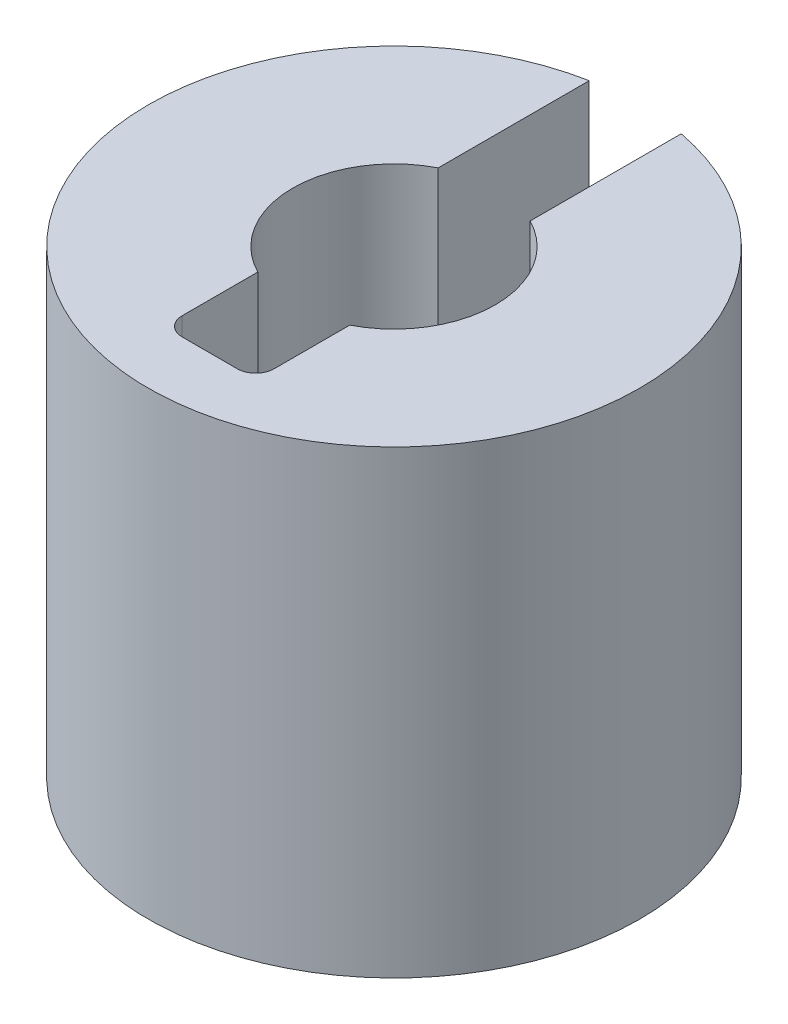
ISO-10303-21;
HEADER;
FILE_DESCRIPTION(('STEP AP214'),'2;1');
FILE_NAME('part.step','',(''),(''),'','','');
FILE_SCHEMA(('AUTOMOTIVE_DESIGN { 1 0 10303 214 1 1 1 1 }'));
ENDSEC;
DATA;
#1=APPLICATION_CONTEXT('core data for automotive mechanical design processes');
#2=APPLICATION_PROTOCOL_DEFINITION('international standard','automotive_design',2000,#1);
#3=PRODUCT_CONTEXT('',#1,'mechanical');
#4=PRODUCT('Part','Part','',(#3));
#5=PRODUCT_RELATED_PRODUCT_CATEGORY('part','',(#4));
#6=PRODUCT_DEFINITION_FORMATION('','',#4);
#7=PRODUCT_DEFINITION_CONTEXT('part definition',#1,'design');
#8=PRODUCT_DEFINITION('design','',#6,#7);
#9=PRODUCT_DEFINITION_SHAPE('','',#8);
#10=(LENGTH_UNIT() NAMED_UNIT(*) SI_UNIT(.MILLI.,.METRE.));
#11=(NAMED_UNIT(*) PLANE_ANGLE_UNIT() SI_UNIT($,.RADIAN.));
#12=(NAMED_UNIT(*) SI_UNIT($,.STERADIAN.) SOLID_ANGLE_UNIT());
#13=UNCERTAINTY_MEASURE_WITH_UNIT(LENGTH_MEASURE(1.E-05),#10,'distance_accuracy_value','');
#14=(GEOMETRIC_REPRESENTATION_CONTEXT(3) GLOBAL_UNCERTAINTY_ASSIGNED_CONTEXT((#13)) GLOBAL_UNIT_ASSIGNED_CONTEXT((#10,
#11,#12)) REPRESENTATION_CONTEXT('',''));
#15=CARTESIAN_POINT('',(0.,0.,0.));
#16=DIRECTION('',(0.,0.,1.));
#17=DIRECTION('',(1.,0.,0.));
#18=AXIS2_PLACEMENT_3D('',#15,#16,#17);
#19=CARTESIAN_POINT('',(-0.75,3.75,3.005));
#20=DIRECTION('',(0.,0.,1.));
#21=DIRECTION('',(1.,0.,0.));
#22=AXIS2_PLACEMENT_3D('',#19,#20,#21);
#23=PLANE('',#22);
#24=DIRECTION('',(0.,1.,0.));
#25=VECTOR('',#24,1.);
#26=CARTESIAN_POINT('',(-0.45,3.75,3.005));
#27=LINE('',#26,#25);
#28=CARTESIAN_POINT('',(-0.45,-3.75,3.005));
#29=VERTEX_POINT('',#28);
#30=CARTESIAN_POINT('',(-0.45,3.75,3.005));
#31=VERTEX_POINT('',#30);
#32=EDGE_CURVE('E114',#29,#31,#27,.T.);
#33=ORIENTED_EDGE('',*,*,#32,.T.);
#34=DIRECTION('',(1.,0.,0.));
#35=VECTOR('',#34,1.);
#36=CARTESIAN_POINT('',(-0.75,3.75,3.005));
#37=LINE('',#36,#35);
#38=CARTESIAN_POINT('',(0.45,3.75,3.005));
#39=VERTEX_POINT('',#38);
#40=EDGE_CURVE('E102',#39,#31,#37,.F.);
#41=ORIENTED_EDGE('',*,*,#40,.F.);
#42=DIRECTION('',(0.,1.,0.));
#43=VECTOR('',#42,1.);
#44=CARTESIAN_POINT('',(0.45,3.75,3.005));
#45=LINE('',#44,#43);
#46=CARTESIAN_POINT('',(0.45,-3.75,3.005));
#47=VERTEX_POINT('',#46);
#48=EDGE_CURVE('E101',#39,#47,#45,.F.);
#49=ORIENTED_EDGE('',*,*,#48,.T.);
#50=DIRECTION('',(1.,0.,0.));
#51=VECTOR('',#50,1.);
#52=CARTESIAN_POINT('',(-0.75,-3.75,3.005));
#53=LINE('',#52,#51);
#54=EDGE_CURVE('E91',#29,#47,#53,.T.);
#55=ORIENTED_EDGE('',*,*,#54,.F.);
#56=EDGE_LOOP('',(#33,#41,#49,#55));
#57=FACE_BOUND('',#56,.T.);
#58=ADVANCED_FACE('F16',(#57),#23,.F.);
#59=CARTESIAN_POINT('',(0.45,3.75,2.705));
#60=DIRECTION('',(0.,1.,0.));
#61=DIRECTION('',(0.,0.,1.));
#62=AXIS2_PLACEMENT_3D('',#59,#60,#61);
#63=CYLINDRICAL_SURFACE('',#62,0.3);
#64=DIRECTION('',(0.,1.,0.));
#65=VECTOR('',#64,1.);
#66=CARTESIAN_POINT('',(0.75,3.75,2.705));
#67=LINE('',#66,#65);
#68=CARTESIAN_POINT('',(0.75,3.75,2.705));
#69=VERTEX_POINT('',#68);
#70=CARTESIAN_POINT('',(0.75,-3.75,2.705));
#71=VERTEX_POINT('',#70);
#72=EDGE_CURVE('E111',#69,#71,#67,.F.);
#73=ORIENTED_EDGE('',*,*,#72,.T.);
#74=CARTESIAN_POINT('',(0.45,-3.75,2.705));
#75=DIRECTION('',(0.,1.,0.));
#76=DIRECTION('',(0.,0.,1.));
#77=AXIS2_PLACEMENT_3D('',#74,#75,#76);
#78=CIRCLE('',#77,0.3);
#79=EDGE_CURVE('E19',#47,#71,#78,.T.);
#80=ORIENTED_EDGE('',*,*,#79,.F.);
#81=ORIENTED_EDGE('',*,*,#48,.F.);
#82=CARTESIAN_POINT('',(0.45,3.75,2.705));
#83=DIRECTION('',(0.,1.,0.));
#84=DIRECTION('',(0.,0.,1.));
#85=AXIS2_PLACEMENT_3D('',#82,#83,#84);
#86=CIRCLE('',#85,0.3);
#87=EDGE_CURVE('E113',#69,#39,#86,.F.);
#88=ORIENTED_EDGE('',*,*,#87,.F.);
#89=EDGE_LOOP('',(#73,#80,#81,#88));
#90=FACE_BOUND('',#89,.T.);
#91=ADVANCED_FACE('F109',(#90),#63,.F.);
#92=CARTESIAN_POINT('',(-0.45,3.75,2.705));
#93=DIRECTION('',(0.,1.,0.));
#94=DIRECTION('',(0.,0.,1.));
#95=AXIS2_PLACEMENT_3D('',#92,#93,#94);
#96=CYLINDRICAL_SURFACE('',#95,0.3);
#97=ORIENTED_EDGE('',*,*,#32,.F.);
#98=CARTESIAN_POINT('',(-0.45,-3.75,2.705));
#99=DIRECTION('',(0.,1.,0.));
#100=DIRECTION('',(0.,0.,1.));
#101=AXIS2_PLACEMENT_3D('',#98,#99,#100);
#102=CIRCLE('',#101,0.3);
#103=CARTESIAN_POINT('',(-0.75,-3.75,2.705));
#104=VERTEX_POINT('',#103);
#105=EDGE_CURVE('E97',#104,#29,#102,.T.);
#106=ORIENTED_EDGE('',*,*,#105,.F.);
#107=DIRECTION('',(0.,1.,0.));
#108=VECTOR('',#107,1.);
#109=CARTESIAN_POINT('',(-0.75,3.75,2.705));
#110=LINE('',#109,#108);
#111=CARTESIAN_POINT('',(-0.75,3.75,2.705));
#112=VERTEX_POINT('',#111);
#113=EDGE_CURVE('E145',#104,#112,#110,.T.);
#114=ORIENTED_EDGE('',*,*,#113,.T.);
#115=CARTESIAN_POINT('',(-0.45,3.75,2.705));
#116=DIRECTION('',(0.,1.,0.));
#117=DIRECTION('',(0.,0.,1.));
#118=AXIS2_PLACEMENT_3D('',#115,#116,#117);
#119=CIRCLE('',#118,0.3);
#120=EDGE_CURVE('E117',#31,#112,#119,.F.);
#121=ORIENTED_EDGE('',*,*,#120,.F.);
#122=EDGE_LOOP('',(#97,#106,#114,#121));
#123=FACE_BOUND('',#122,.T.);
#124=ADVANCED_FACE('F183',(#123),#96,.F.);
#125=CARTESIAN_POINT('',(0.75,3.75,3.005));
#126=DIRECTION('',(1.,0.,0.));
#127=DIRECTION('',(0.,0.,-1.));
#128=AXIS2_PLACEMENT_3D('',#125,#126,#127);
#129=PLANE('',#128);
#130=ORIENTED_EDGE('',*,*,#72,.F.);
#131=DIRECTION('',(0.,0.,-1.));
#132=VECTOR('',#131,1.);
#133=CARTESIAN_POINT('',(0.75,3.75,3.005));
#134=LINE('',#133,#132);
#135=CARTESIAN_POINT('',(0.75,3.75,1.47081643994076));
#136=VERTEX_POINT('',#135);
#137=EDGE_CURVE('E119',#136,#69,#134,.F.);
#138=ORIENTED_EDGE('',*,*,#137,.F.);
#139=DIRECTION('',(0.,-1.,0.));
#140=VECTOR('',#139,1.);
#141=CARTESIAN_POINT('',(0.75,3.75,1.47081643994076));
#142=LINE('',#141,#140);
#143=CARTESIAN_POINT('',(0.75,-3.75,1.47081643994076));
#144=VERTEX_POINT('',#143);
#145=EDGE_CURVE('E153',#136,#144,#142,.T.);
#146=ORIENTED_EDGE('',*,*,#145,.T.);
#147=DIRECTION('',(0.,0.,-1.));
#148=VECTOR('',#147,1.);
#149=CARTESIAN_POINT('',(0.75,-3.75,3.005));
#150=LINE('',#149,#148);
#151=EDGE_CURVE('E144',#71,#144,#150,.T.);
#152=ORIENTED_EDGE('',*,*,#151,.F.);
#153=EDGE_LOOP('',(#130,#138,#146,#152));
#154=FACE_BOUND('',#153,.T.);
#155=ADVANCED_FACE('F180',(#154),#129,.F.);
#156=CARTESIAN_POINT('',(-0.75,3.75,3.005));
#157=DIRECTION('',(-1.,0.,0.));
#158=DIRECTION('',(0.,0.,1.));
#159=AXIS2_PLACEMENT_3D('',#156,#157,#158);
#160=PLANE('',#159);
#161=ORIENTED_EDGE('',*,*,#113,.F.);
#162=DIRECTION('',(0.,0.,1.));
#163=VECTOR('',#162,1.);
#164=CARTESIAN_POINT('',(-0.75,-3.75,3.005));
#165=LINE('',#164,#163);
#166=CARTESIAN_POINT('',(-0.75,-3.75,1.47081643994076));
#167=VERTEX_POINT('',#166);
#168=EDGE_CURVE('E149',#167,#104,#165,.T.);
#169=ORIENTED_EDGE('',*,*,#168,.F.);
#170=DIRECTION('',(0.,-1.,0.));
#171=VECTOR('',#170,1.);
#172=CARTESIAN_POINT('',(-0.75,3.75,1.47081643994076));
#173=LINE('',#172,#171);
#174=CARTESIAN_POINT('',(-0.75,3.75,1.47081643994076));
#175=VERTEX_POINT('',#174);
#176=EDGE_CURVE('E123',#167,#175,#173,.F.);
#177=ORIENTED_EDGE('',*,*,#176,.T.);
#178=DIRECTION('',(0.,0.,1.));
#179=VECTOR('',#178,1.);
#180=CARTESIAN_POINT('',(-0.75,3.75,3.005));
#181=LINE('',#180,#179);
#182=EDGE_CURVE('E148',#112,#175,#181,.F.);
#183=ORIENTED_EDGE('',*,*,#182,.F.);
#184=EDGE_LOOP('',(#161,#169,#177,#183));
#185=FACE_BOUND('',#184,.T.);
#186=ADVANCED_FACE('F182',(#185),#160,.F.);
#187=CARTESIAN_POINT('',(0.,3.75,0.));
#188=DIRECTION('',(0.,-1.,0.));
#189=DIRECTION('',(0.,0.,-1.));
#190=AXIS2_PLACEMENT_3D('',#187,#188,#189);
#191=CYLINDRICAL_SURFACE('',#190,1.651);
#192=ORIENTED_EDGE('',*,*,#145,.F.);
#193=CARTESIAN_POINT('',(0.,3.75,0.));
#194=DIRECTION('',(0.,-1.,0.));
#195=DIRECTION('',(0.,0.,-1.));
#196=AXIS2_PLACEMENT_3D('',#193,#194,#195);
#197=CIRCLE('',#196,1.651);
#198=CARTESIAN_POINT('',(0.75,3.75,-1.47081643994076));
#199=VERTEX_POINT('',#198);
#200=EDGE_CURVE('E127',#199,#136,#197,.T.);
#201=ORIENTED_EDGE('',*,*,#200,.F.);
#202=DIRECTION('',(0.,1.,0.));
#203=VECTOR('',#202,1.);
#204=CARTESIAN_POINT('',(0.75,3.75,-1.47081643994076));
#205=LINE('',#204,#203);
#206=CARTESIAN_POINT('',(0.75,-3.75,-1.47081643994076));
#207=VERTEX_POINT('',#206);
#208=EDGE_CURVE('E126',#199,#207,#205,.F.);
#209=ORIENTED_EDGE('',*,*,#208,.T.);
#210=CARTESIAN_POINT('',(0.,-3.75,0.));
#211=DIRECTION('',(0.,-1.,0.));
#212=DIRECTION('',(0.,0.,-1.));
#213=AXIS2_PLACEMENT_3D('',#210,#211,#212);
#214=CIRCLE('',#213,1.651);
#215=EDGE_CURVE('E122',#207,#144,#214,.T.);
#216=ORIENTED_EDGE('',*,*,#215,.T.);
#217=EDGE_LOOP('',(#192,#201,#209,#216));
#218=FACE_BOUND('',#217,.T.);
#219=ADVANCED_FACE('F178',(#218),#191,.F.);
#220=CARTESIAN_POINT('',(0.,3.75,0.));
#221=DIRECTION('',(0.,-1.,0.));
#222=DIRECTION('',(0.,0.,-1.));
#223=AXIS2_PLACEMENT_3D('',#220,#221,#222);
#224=CYLINDRICAL_SURFACE('',#223,1.651);
#225=DIRECTION('',(0.,1.,0.));
#226=VECTOR('',#225,1.);
#227=CARTESIAN_POINT('',(-0.75,3.75,-1.47081643994076));
#228=LINE('',#227,#226);
#229=CARTESIAN_POINT('',(-0.75,-3.75,-1.47081643994076));
#230=VERTEX_POINT('',#229);
#231=CARTESIAN_POINT('',(-0.75,3.75,-1.47081643994076));
#232=VERTEX_POINT('',#231);
#233=EDGE_CURVE('E160',#230,#232,#228,.T.);
#234=ORIENTED_EDGE('',*,*,#233,.T.);
#235=CARTESIAN_POINT('',(0.,3.75,0.));
#236=DIRECTION('',(0.,-1.,0.));
#237=DIRECTION('',(0.,0.,-1.));
#238=AXIS2_PLACEMENT_3D('',#235,#236,#237);
#239=CIRCLE('',#238,1.651);
#240=EDGE_CURVE('E130',#175,#232,#239,.T.);
#241=ORIENTED_EDGE('',*,*,#240,.F.);
#242=ORIENTED_EDGE('',*,*,#176,.F.);
#243=CARTESIAN_POINT('',(0.,-3.75,0.));
#244=DIRECTION('',(0.,-1.,0.));
#245=DIRECTION('',(0.,0.,-1.));
#246=AXIS2_PLACEMENT_3D('',#243,#244,#245);
#247=CIRCLE('',#246,1.651);
#248=EDGE_CURVE('E120',#167,#230,#247,.T.);
#249=ORIENTED_EDGE('',*,*,#248,.T.);
#250=EDGE_LOOP('',(#234,#241,#242,#249));
#251=FACE_BOUND('',#250,.T.);
#252=ADVANCED_FACE('F211',(#251),#224,.F.);
#253=CARTESIAN_POINT('',(0.,-3.75,0.));
#254=DIRECTION('',(0.,1.,0.));
#255=DIRECTION('',(0.,0.,1.));
#256=AXIS2_PLACEMENT_3D('',#253,#254,#255);
#257=PLANE('',#256);
#258=DIRECTION('',(0.,0.,-1.));
#259=VECTOR('',#258,1.);
#260=CARTESIAN_POINT('',(0.75,-3.75,-1.47081643994076));
#261=LINE('',#260,#259);
#262=CARTESIAN_POINT('',(0.75,-3.75,-3.9341485737069));
#263=VERTEX_POINT('',#262);
#264=EDGE_CURVE('E131',#207,#263,#261,.T.);
#265=ORIENTED_EDGE('',*,*,#264,.T.);
#266=CARTESIAN_POINT('',(0.,-3.75,0.));
#267=DIRECTION('',(0.,-1.,0.));
#268=DIRECTION('',(0.,0.,-1.));
#269=AXIS2_PLACEMENT_3D('',#266,#267,#268);
#270=CIRCLE('',#269,4.005);
#271=CARTESIAN_POINT('',(-0.75,-3.75,-3.9341485737069));
#272=VERTEX_POINT('',#271);
#273=EDGE_CURVE('E134',#272,#263,#270,.F.);
#274=ORIENTED_EDGE('',*,*,#273,.F.);
#275=DIRECTION('',(0.,0.,1.));
#276=VECTOR('',#275,1.);
#277=CARTESIAN_POINT('',(-0.75,-3.75,-1.47081643994076));
#278=LINE('',#277,#276);
#279=EDGE_CURVE('E138',#272,#230,#278,.T.);
#280=ORIENTED_EDGE('',*,*,#279,.T.);
#281=ORIENTED_EDGE('',*,*,#248,.F.);
#282=ORIENTED_EDGE('',*,*,#168,.T.);
#283=ORIENTED_EDGE('',*,*,#105,.T.);
#284=ORIENTED_EDGE('',*,*,#54,.T.);
#285=ORIENTED_EDGE('',*,*,#79,.T.);
#286=ORIENTED_EDGE('',*,*,#151,.T.);
#287=ORIENTED_EDGE('',*,*,#215,.F.);
#288=EDGE_LOOP('',(#265,#274,#280,#281,#282,#283,#284,#285,#286,#287));
#289=FACE_BOUND('',#288,.T.);
#290=ADVANCED_FACE('F93',(#289),#257,.F.);
#291=CARTESIAN_POINT('',(0.75,3.75,-1.47081643994076));
#292=DIRECTION('',(1.,0.,0.));
#293=DIRECTION('',(0.,0.,-1.));
#294=AXIS2_PLACEMENT_3D('',#291,#292,#293);
#295=PLANE('',#294);
#296=ORIENTED_EDGE('',*,*,#208,.F.);
#297=DIRECTION('',(0.,0.,1.));
#298=VECTOR('',#297,1.);
#299=CARTESIAN_POINT('',(0.75,3.75,0.));
#300=LINE('',#299,#298);
#301=CARTESIAN_POINT('',(0.75,3.75,-3.9341485737069));
#302=VERTEX_POINT('',#301);
#303=EDGE_CURVE('E133',#302,#199,#300,.T.);
#304=ORIENTED_EDGE('',*,*,#303,.F.);
#305=DIRECTION('',(0.,-1.,0.));
#306=VECTOR('',#305,1.);
#307=CARTESIAN_POINT('',(0.75,3.75,-3.9341485737069));
#308=LINE('',#307,#306);
#309=EDGE_CURVE('E137',#263,#302,#308,.F.);
#310=ORIENTED_EDGE('',*,*,#309,.F.);
#311=ORIENTED_EDGE('',*,*,#264,.F.);
#312=EDGE_LOOP('',(#296,#304,#310,#311));
#313=FACE_BOUND('',#312,.T.);
#314=ADVANCED_FACE('F173',(#313),#295,.F.);
#315=CARTESIAN_POINT('',(0.,3.75,0.));
#316=DIRECTION('',(0.,1.,0.));
#317=DIRECTION('',(0.,0.,1.));
#318=AXIS2_PLACEMENT_3D('',#315,#316,#317);
#319=PLANE('',#318);
#320=CARTESIAN_POINT('',(0.,3.75,0.));
#321=DIRECTION('',(0.,-1.,0.));
#322=DIRECTION('',(0.,0.,-1.));
#323=AXIS2_PLACEMENT_3D('',#320,#321,#322);
#324=CIRCLE('',#323,4.005);
#325=CARTESIAN_POINT('',(-0.75,3.75,-3.9341485737069));
#326=VERTEX_POINT('',#325);
#327=EDGE_CURVE('E25',#302,#326,#324,.T.);
#328=ORIENTED_EDGE('',*,*,#327,.F.);
#329=ORIENTED_EDGE('',*,*,#303,.T.);
#330=ORIENTED_EDGE('',*,*,#200,.T.);
#331=ORIENTED_EDGE('',*,*,#137,.T.);
#332=ORIENTED_EDGE('',*,*,#87,.T.);
#333=ORIENTED_EDGE('',*,*,#40,.T.);
#334=ORIENTED_EDGE('',*,*,#120,.T.);
#335=ORIENTED_EDGE('',*,*,#182,.T.);
#336=ORIENTED_EDGE('',*,*,#240,.T.);
#337=DIRECTION('',(0.,0.,1.));
#338=VECTOR('',#337,1.);
#339=CARTESIAN_POINT('',(-0.75,3.75,-1.47081643994076));
#340=LINE('',#339,#338);
#341=EDGE_CURVE('E34',#232,#326,#340,.F.);
#342=ORIENTED_EDGE('',*,*,#341,.T.);
#343=EDGE_LOOP('',(#328,#329,#330,#331,#332,#333,#334,#335,#336,#342));
#344=FACE_BOUND('',#343,.T.);
#345=ADVANCED_FACE('F169',(#344),#319,.T.);
#346=CARTESIAN_POINT('',(-0.75,3.75,-1.47081643994076));
#347=DIRECTION('',(-1.,0.,0.));
#348=DIRECTION('',(0.,0.,1.));
#349=AXIS2_PLACEMENT_3D('',#346,#347,#348);
#350=PLANE('',#349);
#351=DIRECTION('',(0.,-1.,0.));
#352=VECTOR('',#351,1.);
#353=CARTESIAN_POINT('',(-0.75,3.75,-3.9341485737069));
#354=LINE('',#353,#352);
#355=EDGE_CURVE('E11',#326,#272,#354,.T.);
#356=ORIENTED_EDGE('',*,*,#355,.F.);
#357=ORIENTED_EDGE('',*,*,#341,.F.);
#358=ORIENTED_EDGE('',*,*,#233,.F.);
#359=ORIENTED_EDGE('',*,*,#279,.F.);
#360=EDGE_LOOP('',(#356,#357,#358,#359));
#361=FACE_BOUND('',#360,.T.);
#362=ADVANCED_FACE('F196',(#361),#350,.F.);
#363=CARTESIAN_POINT('',(0.,3.75,0.));
#364=DIRECTION('',(0.,-1.,0.));
#365=DIRECTION('',(0.,0.,-1.));
#366=AXIS2_PLACEMENT_3D('',#363,#364,#365);
#367=CYLINDRICAL_SURFACE('',#366,4.005);
#368=ORIENTED_EDGE('',*,*,#327,.T.);
#369=ORIENTED_EDGE('',*,*,#355,.T.);
#370=ORIENTED_EDGE('',*,*,#273,.T.);
#371=ORIENTED_EDGE('',*,*,#309,.T.);
#372=EDGE_LOOP('',(#368,#369,#370,#371));
#373=FACE_BOUND('',#372,.T.);
#374=ADVANCED_FACE('F194',(#373),#367,.T.);
#375=CLOSED_SHELL('',(#58,#91,#124,#155,#186,#219,#252,#290,#314,#345,#362,#374));
#376=MANIFOLD_SOLID_BREP('B1',#375);
#377=ADVANCED_BREP_SHAPE_REPRESENTATION('',(#18,#376),#14);
#378=SHAPE_DEFINITION_REPRESENTATION(#9,#377);
ENDSEC;
END-ISO-10303-21;
